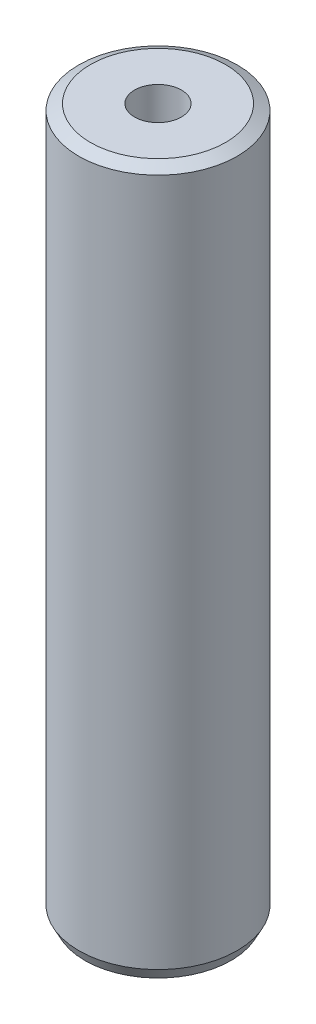
ISO-10303-21;
HEADER;
FILE_DESCRIPTION(('STEP AP214'),'2;1');
FILE_NAME('part.step','',(''),(''),'','','');
FILE_SCHEMA(('AUTOMOTIVE_DESIGN { 1 0 10303 214 1 1 1 1 }'));
ENDSEC;
DATA;
#1=APPLICATION_CONTEXT('core data for automotive mechanical design processes');
#2=APPLICATION_PROTOCOL_DEFINITION('international standard','automotive_design',2000,#1);
#3=PRODUCT_CONTEXT('',#1,'mechanical');
#4=PRODUCT('Part','Part','',(#3));
#5=PRODUCT_RELATED_PRODUCT_CATEGORY('part','',(#4));
#6=PRODUCT_DEFINITION_FORMATION('','',#4);
#7=PRODUCT_DEFINITION_CONTEXT('part definition',#1,'design');
#8=PRODUCT_DEFINITION('design','',#6,#7);
#9=PRODUCT_DEFINITION_SHAPE('','',#8);
#10=(LENGTH_UNIT() NAMED_UNIT(*) SI_UNIT(.MILLI.,.METRE.));
#11=(NAMED_UNIT(*) PLANE_ANGLE_UNIT() SI_UNIT($,.RADIAN.));
#12=(NAMED_UNIT(*) SI_UNIT($,.STERADIAN.) SOLID_ANGLE_UNIT());
#13=UNCERTAINTY_MEASURE_WITH_UNIT(LENGTH_MEASURE(1.E-05),#10,'distance_accuracy_value','');
#14=(GEOMETRIC_REPRESENTATION_CONTEXT(3) GLOBAL_UNCERTAINTY_ASSIGNED_CONTEXT((#13)) GLOBAL_UNIT_ASSIGNED_CONTEXT((#10,
#11,#12)) REPRESENTATION_CONTEXT('',''));
#15=CARTESIAN_POINT('',(0.,0.,0.));
#16=DIRECTION('',(0.,0.,1.));
#17=DIRECTION('',(1.,0.,0.));
#18=AXIS2_PLACEMENT_3D('',#15,#16,#17);
#19=CARTESIAN_POINT('',(0.,467.791931014437,0.));
#20=DIRECTION('',(0.,-1.,0.));
#21=DIRECTION('',(0.,0.,-1.));
#22=AXIS2_PLACEMENT_3D('',#19,#20,#21);
#23=CYLINDRICAL_SURFACE('',#22,52.5);
#24=CARTESIAN_POINT('',(0.,463.759427453792,0.));
#25=DIRECTION('',(0.,1.,0.));
#26=DIRECTION('',(0.,0.,1.));
#27=AXIS2_PLACEMENT_3D('',#24,#25,#26);
#28=CIRCLE('',#27,52.5);
#29=CARTESIAN_POINT('',(0.,463.759427453792,-52.5));
#30=VERTEX_POINT('',#29);
#31=EDGE_CURVE('E50',#30,#30,#28,.F.);
#32=CARTESIAN_POINT('',(0.,7.70679431597099,0.));
#33=DIRECTION('',(0.,1.,0.));
#34=DIRECTION('',(0.,0.,1.));
#35=AXIS2_PLACEMENT_3D('',#32,#33,#34);
#36=CIRCLE('',#35,52.5);
#37=CARTESIAN_POINT('',(0.,7.70679431597093,-52.5));
#38=VERTEX_POINT('',#37);
#39=EDGE_CURVE('E51',#38,#38,#36,.T.);
#40=CARTESIAN_POINT('',(0.,463.759427453792,-52.5));
#41=CARTESIAN_POINT('',(0.,459.00887919194,-52.5));
#42=CARTESIAN_POINT('',(0.,454.258330930087,-52.5));
#43=CARTESIAN_POINT('',(0.,444.757234406383,-52.5));
#44=CARTESIAN_POINT('',(0.,440.00668614453,-52.5));
#45=CARTESIAN_POINT('',(0.,430.505589620826,-52.5));
#46=CARTESIAN_POINT('',(0.,425.755041358973,-52.5));
#47=CARTESIAN_POINT('',(0.,416.253944835269,-52.5));
#48=CARTESIAN_POINT('',(0.,411.503396573416,-52.5));
#49=CARTESIAN_POINT('',(0.,402.002300049712,-52.5));
#50=CARTESIAN_POINT('',(0.,397.25175178786,-52.5));
#51=CARTESIAN_POINT('',(0.,387.750655264155,-52.5));
#52=CARTESIAN_POINT('',(0.,383.000107002303,-52.5));
#53=CARTESIAN_POINT('',(0.,373.499010478598,-52.5));
#54=CARTESIAN_POINT('',(0.,368.748462216746,-52.5));
#55=CARTESIAN_POINT('',(0.,359.247365693041,-52.5));
#56=CARTESIAN_POINT('',(0.,354.496817431189,-52.5));
#57=CARTESIAN_POINT('',(0.,344.995720907484,-52.5));
#58=CARTESIAN_POINT('',(0.,340.245172645632,-52.5));
#59=CARTESIAN_POINT('',(0.,330.744076121927,-52.5));
#60=CARTESIAN_POINT('',(0.,325.993527860075,-52.5));
#61=CARTESIAN_POINT('',(0.,316.49243133637,-52.5));
#62=CARTESIAN_POINT('',(0.,311.741883074518,-52.5));
#63=CARTESIAN_POINT('',(0.,302.240786550814,-52.5));
#64=CARTESIAN_POINT('',(0.,297.490238288961,-52.5));
#65=CARTESIAN_POINT('',(0.,287.989141765257,-52.5));
#66=CARTESIAN_POINT('',(0.,283.238593503404,-52.5));
#67=CARTESIAN_POINT('',(0.,273.7374969797,-52.5));
#68=CARTESIAN_POINT('',(0.,268.986948717847,-52.5));
#69=CARTESIAN_POINT('',(0.,259.485852194143,-52.5));
#70=CARTESIAN_POINT('',(0.,254.735303932291,-52.5));
#71=CARTESIAN_POINT('',(0.,245.234207408586,-52.5));
#72=CARTESIAN_POINT('',(0.,240.483659146734,-52.5));
#73=CARTESIAN_POINT('',(0.,230.982562623029,-52.5));
#74=CARTESIAN_POINT('',(0.,226.232014361177,-52.5));
#75=CARTESIAN_POINT('',(0.,216.730917837472,-52.5));
#76=CARTESIAN_POINT('',(0.,211.98036957562,-52.5));
#77=CARTESIAN_POINT('',(0.,202.479273051915,-52.5));
#78=CARTESIAN_POINT('',(0.,197.728724790063,-52.5));
#79=CARTESIAN_POINT('',(0.,188.227628266358,-52.5));
#80=CARTESIAN_POINT('',(0.,183.477080004506,-52.5));
#81=CARTESIAN_POINT('',(0.,173.975983480801,-52.5));
#82=CARTESIAN_POINT('',(0.,169.225435218949,-52.5));
#83=CARTESIAN_POINT('',(0.,159.724338695245,-52.5));
#84=CARTESIAN_POINT('',(0.,154.973790433392,-52.5));
#85=CARTESIAN_POINT('',(0.,145.472693909688,-52.5));
#86=CARTESIAN_POINT('',(0.,140.722145647835,-52.5));
#87=CARTESIAN_POINT('',(0.,131.221049124131,-52.5));
#88=CARTESIAN_POINT('',(0.,126.470500862278,-52.5));
#89=CARTESIAN_POINT('',(0.,116.969404338574,-52.5));
#90=CARTESIAN_POINT('',(0.,112.218856076722,-52.5));
#91=CARTESIAN_POINT('',(0.,102.717759553017,-52.5));
#92=CARTESIAN_POINT('',(0.,97.9672112911647,-52.5));
#93=CARTESIAN_POINT('',(0.,88.4661147674601,-52.5));
#94=CARTESIAN_POINT('',(0.,83.7155665056078,-52.5));
#95=CARTESIAN_POINT('',(0.,74.2144699819032,-52.5));
#96=CARTESIAN_POINT('',(0.,69.4639217200509,-52.5));
#97=CARTESIAN_POINT('',(0.,59.9628251963463,-52.5));
#98=CARTESIAN_POINT('',(0.,55.212276934494,-52.5));
#99=CARTESIAN_POINT('',(0.,45.7111804107894,-52.5));
#100=CARTESIAN_POINT('',(0.,40.9606321489371,-52.5));
#101=CARTESIAN_POINT('',(0.,31.4595356252325,-52.5));
#102=CARTESIAN_POINT('',(0.,26.7089873633802,-52.5));
#103=CARTESIAN_POINT('',(0.,17.2078908396756,-52.5));
#104=CARTESIAN_POINT('',(0.,12.4573425778233,-52.5));
#105=CARTESIAN_POINT('',(0.,7.70679431597093,-52.5));
#106=B_SPLINE_CURVE_WITH_KNOTS('',3,(#40,#41,#42,#43,#44,#45,#46,#47,#48,#49,#50,#51,#52,#53,
#54,#55,#56,#57,#58,#59,#60,#61,#62,#63,#64,#65,#66,#67,#68,#69,#70,#71,#72,#73,#74,#75,#76,#77,
#78,#79,#80,#81,#82,#83,#84,#85,#86,#87,#88,#89,#90,#91,#92,#93,#94,#95,#96,#97,#98,#99,#100,
#101,#102,#103,#104,#105),.UNSPECIFIED.,.F.,.F.,(4,2,2,2,2,2,2,2,2,2,2,2,2,2,2,2,2,2,2,2,2,2,2,
2,2,2,2,2,2,2,2,2,4),(0.,14.2516447855569,28.5032895711138,42.7549343566707,57.0065791422276,
71.2582239277845,85.5098687133414,99.7615134988983,114.013158284455,128.264803070012,
142.516447855569,156.768092641126,171.019737426683,185.27138221224,199.523026997797,
213.774671783354,228.02631656891,242.277961354467,256.529606140024,270.781250925581,
285.032895711138,299.284540496695,313.536185282252,327.787830067809,342.039474853366,
356.291119638922,370.542764424479,384.794409210036,399.046053995593,413.29769878115,
427.549343566707,441.800988352264,456.052633137821),.UNSPECIFIED.);
#107=EDGE_CURVE('BSEAM39',#30,#38,#106,.T.);
#108=ORIENTED_EDGE('',*,*,#31,.T.);
#109=ORIENTED_EDGE('',*,*,#39,.T.);
#110=ORIENTED_EDGE('',*,*,#107,.T.);
#111=ORIENTED_EDGE('',*,*,#107,.F.);
#112=EDGE_LOOP('',(#108,#110,#109,#111));
#113=FACE_BOUND('',#112,.T.);
#114=ADVANCED_FACE('F39',(#113),#23,.T.);
#115=CARTESIAN_POINT('',(0.,467.791931014437,0.));
#116=DIRECTION('',(0.,1.,0.));
#117=DIRECTION('',(0.,0.,1.));
#118=AXIS2_PLACEMENT_3D('',#115,#116,#117);
#119=PLANE('',#118);
#120=CARTESIAN_POINT('',(0.,467.791931014437,0.));
#121=DIRECTION('',(0.,1.,0.));
#122=DIRECTION('',(0.,0.,1.));
#123=AXIS2_PLACEMENT_3D('',#120,#121,#122);
#124=CIRCLE('',#123,44.7932056840302);
#125=CARTESIAN_POINT('',(0.,467.791931014437,44.7932056840302));
#126=VERTEX_POINT('',#125);
#127=EDGE_CURVE('E54',#126,#126,#124,.T.);
#128=ORIENTED_EDGE('',*,*,#127,.T.);
#129=EDGE_LOOP('',(#128));
#130=FACE_BOUND('',#129,.T.);
#131=CARTESIAN_POINT('',(0.,467.791931014437,0.));
#132=DIRECTION('',(0.,1.,0.));
#133=DIRECTION('',(0.,0.,1.));
#134=AXIS2_PLACEMENT_3D('',#131,#132,#133);
#135=CIRCLE('',#134,15.52387521689);
#136=CARTESIAN_POINT('',(0.,467.791931014437,-15.52387521689));
#137=VERTEX_POINT('',#136);
#138=EDGE_CURVE('E58',#137,#137,#135,.T.);
#139=ORIENTED_EDGE('',*,*,#138,.F.);
#140=EDGE_LOOP('',(#139));
#141=FACE_BOUND('',#140,.T.);
#142=ADVANCED_FACE('F69',(#130,#141),#119,.T.);
#143=CARTESIAN_POINT('',(0.,0.,0.));
#144=DIRECTION('',(0.,1.,0.));
#145=DIRECTION('',(0.,0.,1.));
#146=AXIS2_PLACEMENT_3D('',#143,#144,#145);
#147=PLANE('',#146);
#148=CARTESIAN_POINT('',(0.,0.,0.));
#149=DIRECTION('',(0.,1.,0.));
#150=DIRECTION('',(0.,0.,1.));
#151=AXIS2_PLACEMENT_3D('',#148,#149,#150);
#152=CIRCLE('',#151,48.467496439354);
#153=CARTESIAN_POINT('',(0.,0.,48.467496439354));
#154=VERTEX_POINT('',#153);
#155=EDGE_CURVE('E10',#154,#154,#152,.F.);
#156=ORIENTED_EDGE('',*,*,#155,.T.);
#157=EDGE_LOOP('',(#156));
#158=FACE_BOUND('',#157,.T.);
#159=CARTESIAN_POINT('',(0.,0.,0.));
#160=DIRECTION('',(0.,1.,0.));
#161=DIRECTION('',(0.,0.,1.));
#162=AXIS2_PLACEMENT_3D('',#159,#160,#161);
#163=CIRCLE('',#162,15.52387521689);
#164=CARTESIAN_POINT('',(0.,0.,-15.52387521689));
#165=VERTEX_POINT('',#164);
#166=EDGE_CURVE('E63',#165,#165,#163,.T.);
#167=ORIENTED_EDGE('',*,*,#166,.T.);
#168=EDGE_LOOP('',(#167));
#169=FACE_BOUND('',#168,.T.);
#170=ADVANCED_FACE('F75',(#158,#169),#147,.F.);
#171=CARTESIAN_POINT('',(0.,467.791931014437,0.));
#172=DIRECTION('',(0.,-1.,0.));
#173=DIRECTION('',(0.,0.,-1.));
#174=AXIS2_PLACEMENT_3D('',#171,#172,#173);
#175=CYLINDRICAL_SURFACE('',#174,15.52387521689);
#176=CARTESIAN_POINT('',(0.,467.791931014437,-15.52387521689));
#177=CARTESIAN_POINT('',(0.,462.919098399703,-15.52387521689));
#178=CARTESIAN_POINT('',(0.,458.04626578497,-15.52387521689));
#179=CARTESIAN_POINT('',(0.,448.300600555502,-15.52387521689));
#180=CARTESIAN_POINT('',(0.,443.427767940769,-15.52387521689));
#181=CARTESIAN_POINT('',(0.,433.682102711301,-15.52387521689));
#182=CARTESIAN_POINT('',(0.,428.809270096567,-15.52387521689));
#183=CARTESIAN_POINT('',(0.,419.0636048671,-15.52387521689));
#184=CARTESIAN_POINT('',(0.,414.190772252366,-15.52387521689));
#185=CARTESIAN_POINT('',(0.,404.445107022899,-15.52387521689));
#186=CARTESIAN_POINT('',(0.,399.572274408165,-15.52387521689));
#187=CARTESIAN_POINT('',(0.,389.826609178698,-15.52387521689));
#188=CARTESIAN_POINT('',(0.,384.953776563964,-15.52387521689));
#189=CARTESIAN_POINT('',(0.,375.208111334496,-15.52387521689));
#190=CARTESIAN_POINT('',(0.,370.335278719763,-15.52387521689));
#191=CARTESIAN_POINT('',(0.,360.589613490295,-15.52387521689));
#192=CARTESIAN_POINT('',(0.,355.716780875562,-15.52387521689));
#193=CARTESIAN_POINT('',(0.,345.971115646094,-15.52387521689));
#194=CARTESIAN_POINT('',(0.,341.09828303136,-15.52387521689));
#195=CARTESIAN_POINT('',(0.,331.352617801893,-15.52387521689));
#196=CARTESIAN_POINT('',(0.,326.479785187159,-15.52387521689));
#197=CARTESIAN_POINT('',(0.,316.734119957692,-15.52387521689));
#198=CARTESIAN_POINT('',(0.,311.861287342958,-15.52387521689));
#199=CARTESIAN_POINT('',(0.,302.115622113491,-15.52387521689));
#200=CARTESIAN_POINT('',(0.,297.242789498757,-15.52387521689));
#201=CARTESIAN_POINT('',(0.,287.497124269289,-15.52387521689));
#202=CARTESIAN_POINT('',(0.,282.624291654556,-15.52387521689));
#203=CARTESIAN_POINT('',(0.,272.878626425088,-15.52387521689));
#204=CARTESIAN_POINT('',(0.,268.005793810355,-15.52387521689));
#205=CARTESIAN_POINT('',(0.,258.260128580887,-15.52387521689));
#206=CARTESIAN_POINT('',(0.,253.387295966153,-15.52387521689));
#207=CARTESIAN_POINT('',(0.,243.641630736686,-15.52387521689));
#208=CARTESIAN_POINT('',(0.,238.768798121952,-15.52387521689));
#209=CARTESIAN_POINT('',(0.,229.023132892485,-15.52387521689));
#210=CARTESIAN_POINT('',(0.,224.150300277751,-15.52387521689));
#211=CARTESIAN_POINT('',(0.,214.404635048284,-15.52387521689));
#212=CARTESIAN_POINT('',(0.,209.53180243355,-15.52387521689));
#213=CARTESIAN_POINT('',(0.,199.786137204082,-15.52387521689));
#214=CARTESIAN_POINT('',(0.,194.913304589349,-15.52387521689));
#215=CARTESIAN_POINT('',(0.,185.167639359881,-15.52387521689));
#216=CARTESIAN_POINT('',(0.,180.294806745148,-15.52387521689));
#217=CARTESIAN_POINT('',(0.,170.54914151568,-15.52387521689));
#218=CARTESIAN_POINT('',(0.,165.676308900946,-15.52387521689));
#219=CARTESIAN_POINT('',(0.,155.930643671479,-15.52387521689));
#220=CARTESIAN_POINT('',(0.,151.057811056745,-15.52387521689));
#221=CARTESIAN_POINT('',(0.,141.312145827278,-15.52387521689));
#222=CARTESIAN_POINT('',(0.,136.439313212544,-15.52387521689));
#223=CARTESIAN_POINT('',(0.,126.693647983077,-15.52387521689));
#224=CARTESIAN_POINT('',(0.,121.820815368343,-15.52387521689));
#225=CARTESIAN_POINT('',(0.,112.075150138876,-15.52387521689));
#226=CARTESIAN_POINT('',(0.,107.202317524142,-15.52387521689));
#227=CARTESIAN_POINT('',(0.,97.4566522946744,-15.52387521689));
#228=CARTESIAN_POINT('',(0.,92.5838196799406,-15.52387521689));
#229=CARTESIAN_POINT('',(0.,82.8381544504732,-15.52387521689));
#230=CARTESIAN_POINT('',(0.,77.9653218357395,-15.52387521689));
#231=CARTESIAN_POINT('',(0.,68.219656606272,-15.52387521689));
#232=CARTESIAN_POINT('',(0.,63.3468239915383,-15.52387521689));
#233=CARTESIAN_POINT('',(0.,53.6011587620709,-15.52387521689));
#234=CARTESIAN_POINT('',(0.,48.7283261473371,-15.52387521689));
#235=CARTESIAN_POINT('',(0.,38.9826609178697,-15.52387521689));
#236=CARTESIAN_POINT('',(0.,34.109828303136,-15.52387521689));
#237=CARTESIAN_POINT('',(0.,24.3641630736685,-15.52387521689));
#238=CARTESIAN_POINT('',(0.,19.4913304589348,-15.52387521689));
#239=CARTESIAN_POINT('',(0.,9.74566522946738,-15.52387521689));
#240=CARTESIAN_POINT('',(0.,4.87283261473365,-15.52387521689));
#241=CARTESIAN_POINT('',(0.,0.,-15.52387521689));
#242=B_SPLINE_CURVE_WITH_KNOTS('',3,(#176,#177,#178,#179,#180,#181,#182,#183,#184,#185,#186,
#187,#188,#189,#190,#191,#192,#193,#194,#195,#196,#197,#198,#199,#200,#201,#202,#203,#204,#205,
#206,#207,#208,#209,#210,#211,#212,#213,#214,#215,#216,#217,#218,#219,#220,#221,#222,#223,#224,
#225,#226,#227,#228,#229,#230,#231,#232,#233,#234,#235,#236,#237,#238,#239,#240,#241),
.UNSPECIFIED.,.F.,.F.,(4,2,2,2,2,2,2,2,2,2,2,2,2,2,2,2,2,2,2,2,2,2,2,2,2,2,2,2,2,2,2,2,4),(0.,
14.6184978442012,29.2369956884023,43.8554935326035,58.4739913768046,73.0924892210058,
87.7109870652069,102.329484909408,116.947982753609,131.56648059781,146.184978442012,
160.803476286213,175.421974130414,190.040471974615,204.658969818816,219.277467663017,
233.895965507219,248.51446335142,263.132961195621,277.751459039822,292.369956884023,
306.988454728224,321.606952572426,336.225450416627,350.843948260828,365.462446105029,
380.08094394923,394.699441793431,409.317939637633,423.936437481834,438.554935326035,
453.173433170236,467.791931014437),.UNSPECIFIED.);
#243=EDGE_CURVE('BSEAM70',#137,#165,#242,.T.);
#244=ORIENTED_EDGE('',*,*,#138,.T.);
#245=ORIENTED_EDGE('',*,*,#166,.F.);
#246=ORIENTED_EDGE('',*,*,#243,.T.);
#247=ORIENTED_EDGE('',*,*,#243,.F.);
#248=EDGE_LOOP('',(#244,#246,#245,#247));
#249=FACE_BOUND('',#248,.T.);
#250=ADVANCED_FACE('F70',(#249),#175,.F.);
#251=CARTESIAN_POINT('',(0.,467.791931014437,0.));
#252=DIRECTION('',(0.,-1.,0.));
#253=DIRECTION('',(0.,0.,-1.));
#254=AXIS2_PLACEMENT_3D('',#251,#252,#253);
#255=CONICAL_SURFACE('',#254,44.7932056840302,1.08872998908442);
#256=ORIENTED_EDGE('',*,*,#31,.F.);
#257=EDGE_LOOP('',(#256));
#258=FACE_BOUND('',#257,.T.);
#259=ORIENTED_EDGE('',*,*,#127,.F.);
#260=EDGE_LOOP('',(#259));
#261=FACE_BOUND('',#260,.T.);
#262=ADVANCED_FACE('F81',(#258,#261),#255,.T.);
#263=CARTESIAN_POINT('',(0.,7.70679431597099,0.));
#264=DIRECTION('',(0.,1.,0.));
#265=DIRECTION('',(0.,0.,1.));
#266=AXIS2_PLACEMENT_3D('',#263,#264,#265);
#267=CONICAL_SURFACE('',#266,52.5,0.482066337710473);
#268=ORIENTED_EDGE('',*,*,#155,.F.);
#269=EDGE_LOOP('',(#268));
#270=FACE_BOUND('',#269,.T.);
#271=ORIENTED_EDGE('',*,*,#39,.F.);
#272=EDGE_LOOP('',(#271));
#273=FACE_BOUND('',#272,.T.);
#274=ADVANCED_FACE('F45',(#270,#273),#267,.T.);
#275=CLOSED_SHELL('',(#114,#142,#170,#250,#262,#274));
#276=MANIFOLD_SOLID_BREP('B2',#275);
#277=ADVANCED_BREP_SHAPE_REPRESENTATION('',(#18,#276),#14);
#278=SHAPE_DEFINITION_REPRESENTATION(#9,#277);
ENDSEC;
END-ISO-10303-21;
